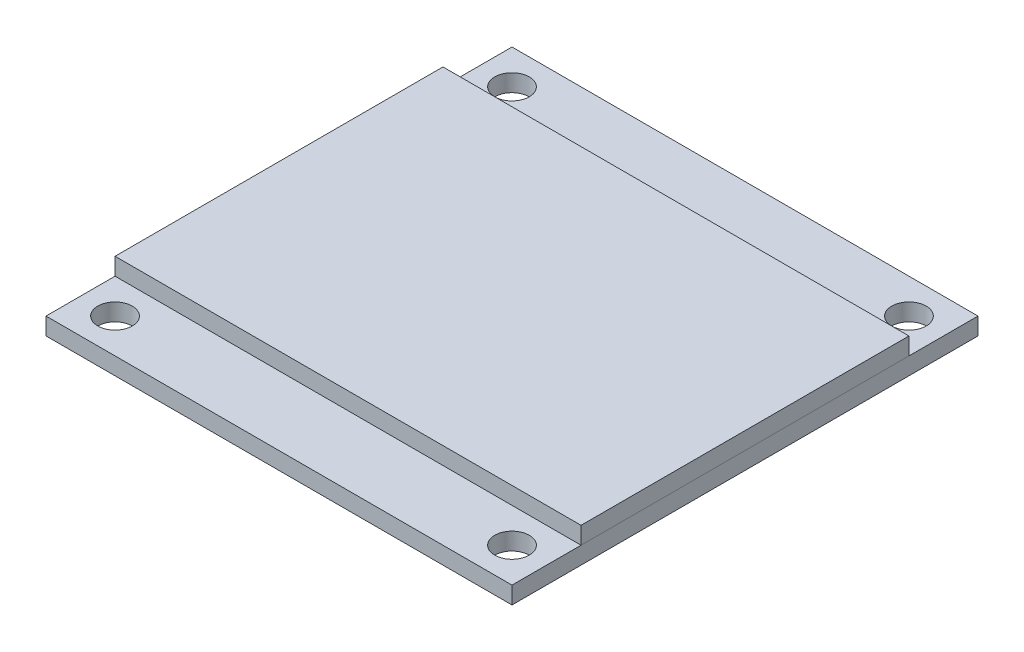
ISO-10303-21;
HEADER;
FILE_DESCRIPTION(('STEP AP214'),'2;1');
FILE_NAME('part.step','',(''),(''),'','','');
FILE_SCHEMA(('AUTOMOTIVE_DESIGN { 1 0 10303 214 1 1 1 1 }'));
ENDSEC;
DATA;
#1=APPLICATION_CONTEXT('core data for automotive mechanical design processes');
#2=APPLICATION_PROTOCOL_DEFINITION('international standard','automotive_design',2000,#1);
#3=PRODUCT_CONTEXT('',#1,'mechanical');
#4=PRODUCT('Part','Part','',(#3));
#5=PRODUCT_RELATED_PRODUCT_CATEGORY('part','',(#4));
#6=PRODUCT_DEFINITION_FORMATION('','',#4);
#7=PRODUCT_DEFINITION_CONTEXT('part definition',#1,'design');
#8=PRODUCT_DEFINITION('design','',#6,#7);
#9=PRODUCT_DEFINITION_SHAPE('','',#8);
#10=(LENGTH_UNIT() NAMED_UNIT(*) SI_UNIT(.MILLI.,.METRE.));
#11=(NAMED_UNIT(*) PLANE_ANGLE_UNIT() SI_UNIT($,.RADIAN.));
#12=(NAMED_UNIT(*) SI_UNIT($,.STERADIAN.) SOLID_ANGLE_UNIT());
#13=UNCERTAINTY_MEASURE_WITH_UNIT(LENGTH_MEASURE(1.E-05),#10,'distance_accuracy_value','');
#14=(GEOMETRIC_REPRESENTATION_CONTEXT(3) GLOBAL_UNCERTAINTY_ASSIGNED_CONTEXT((#13)) GLOBAL_UNIT_ASSIGNED_CONTEXT((#10,
#11,#12)) REPRESENTATION_CONTEXT('',''));
#15=CARTESIAN_POINT('',(0.,0.,0.));
#16=DIRECTION('',(0.,0.,1.));
#17=DIRECTION('',(1.,0.,0.));
#18=AXIS2_PLACEMENT_3D('',#15,#16,#17);
#19=CARTESIAN_POINT('',(13.5,2.,-9.5));
#20=DIRECTION('',(-1.,0.,0.));
#21=DIRECTION('',(0.,0.,1.));
#22=AXIS2_PLACEMENT_3D('',#19,#20,#21);
#23=PLANE('',#22);
#24=DIRECTION('',(0.,0.,-1.));
#25=VECTOR('',#24,1.);
#26=CARTESIAN_POINT('',(13.5,1.,-9.5));
#27=LINE('',#26,#25);
#28=CARTESIAN_POINT('',(13.5,1.,9.5));
#29=VERTEX_POINT('',#28);
#30=CARTESIAN_POINT('',(13.5,1.,-9.5));
#31=VERTEX_POINT('',#30);
#32=EDGE_CURVE('E108',#29,#31,#27,.T.);
#33=ORIENTED_EDGE('',*,*,#32,.T.);
#34=DIRECTION('',(0.,-1.,0.));
#35=VECTOR('',#34,1.);
#36=CARTESIAN_POINT('',(13.5,2.,-9.5));
#37=LINE('',#36,#35);
#38=CARTESIAN_POINT('',(13.5,2.,-9.5));
#39=VERTEX_POINT('',#38);
#40=EDGE_CURVE('E12',#39,#31,#37,.T.);
#41=ORIENTED_EDGE('',*,*,#40,.F.);
#42=DIRECTION('',(0.,0.,-1.));
#43=VECTOR('',#42,1.);
#44=CARTESIAN_POINT('',(13.5,2.,-9.5));
#45=LINE('',#44,#43);
#46=CARTESIAN_POINT('',(13.5,2.,9.5));
#47=VERTEX_POINT('',#46);
#48=EDGE_CURVE('E96',#47,#39,#45,.T.);
#49=ORIENTED_EDGE('',*,*,#48,.F.);
#50=DIRECTION('',(0.,-1.,0.));
#51=VECTOR('',#50,1.);
#52=CARTESIAN_POINT('',(13.5,2.,9.5));
#53=LINE('',#52,#51);
#54=EDGE_CURVE('E104',#47,#29,#53,.T.);
#55=ORIENTED_EDGE('',*,*,#54,.T.);
#56=EDGE_LOOP('',(#33,#41,#49,#55));
#57=FACE_BOUND('',#56,.T.);
#58=ADVANCED_FACE('F45',(#57),#23,.F.);
#59=CARTESIAN_POINT('',(-13.5,2.,-9.5));
#60=DIRECTION('',(0.,0.,1.));
#61=DIRECTION('',(1.,0.,0.));
#62=AXIS2_PLACEMENT_3D('',#59,#60,#61);
#63=PLANE('',#62);
#64=DIRECTION('',(-1.,0.,0.));
#65=VECTOR('',#64,1.);
#66=CARTESIAN_POINT('',(-13.5,1.,-9.5));
#67=LINE('',#66,#65);
#68=CARTESIAN_POINT('',(-13.5,1.,-9.5));
#69=VERTEX_POINT('',#68);
#70=EDGE_CURVE('E100',#31,#69,#67,.T.);
#71=ORIENTED_EDGE('',*,*,#70,.T.);
#72=DIRECTION('',(0.,-1.,0.));
#73=VECTOR('',#72,1.);
#74=CARTESIAN_POINT('',(-13.5,2.,-9.5));
#75=LINE('',#74,#73);
#76=CARTESIAN_POINT('',(-13.5,2.,-9.5));
#77=VERTEX_POINT('',#76);
#78=EDGE_CURVE('E53',#77,#69,#75,.T.);
#79=ORIENTED_EDGE('',*,*,#78,.F.);
#80=DIRECTION('',(-1.,0.,0.));
#81=VECTOR('',#80,1.);
#82=CARTESIAN_POINT('',(-13.5,2.,-9.5));
#83=LINE('',#82,#81);
#84=EDGE_CURVE('E91',#39,#77,#83,.T.);
#85=ORIENTED_EDGE('',*,*,#84,.F.);
#86=ORIENTED_EDGE('',*,*,#40,.T.);
#87=EDGE_LOOP('',(#71,#79,#85,#86));
#88=FACE_BOUND('',#87,.T.);
#89=ADVANCED_FACE('F99',(#88),#63,.F.);
#90=CARTESIAN_POINT('',(-13.5,2.,-9.5));
#91=DIRECTION('',(1.,0.,0.));
#92=DIRECTION('',(0.,0.,-1.));
#93=AXIS2_PLACEMENT_3D('',#90,#91,#92);
#94=PLANE('',#93);
#95=DIRECTION('',(0.,0.,1.));
#96=VECTOR('',#95,1.);
#97=CARTESIAN_POINT('',(-13.5,1.,-9.5));
#98=LINE('',#97,#96);
#99=CARTESIAN_POINT('',(-13.5,1.,9.5));
#100=VERTEX_POINT('',#99);
#101=EDGE_CURVE('E78',#69,#100,#98,.T.);
#102=ORIENTED_EDGE('',*,*,#101,.T.);
#103=DIRECTION('',(0.,-1.,0.));
#104=VECTOR('',#103,1.);
#105=CARTESIAN_POINT('',(-13.5,2.,9.5));
#106=LINE('',#105,#104);
#107=CARTESIAN_POINT('',(-13.5,2.,9.5));
#108=VERTEX_POINT('',#107);
#109=EDGE_CURVE('E101',#108,#100,#106,.T.);
#110=ORIENTED_EDGE('',*,*,#109,.F.);
#111=DIRECTION('',(0.,0.,1.));
#112=VECTOR('',#111,1.);
#113=CARTESIAN_POINT('',(-13.5,2.,-9.5));
#114=LINE('',#113,#112);
#115=EDGE_CURVE('E94',#77,#108,#114,.T.);
#116=ORIENTED_EDGE('',*,*,#115,.F.);
#117=ORIENTED_EDGE('',*,*,#78,.T.);
#118=EDGE_LOOP('',(#102,#110,#116,#117));
#119=FACE_BOUND('',#118,.T.);
#120=ADVANCED_FACE('F102',(#119),#94,.F.);
#121=CARTESIAN_POINT('',(-13.5,2.,9.5));
#122=DIRECTION('',(0.,0.,-1.));
#123=DIRECTION('',(-1.,0.,0.));
#124=AXIS2_PLACEMENT_3D('',#121,#122,#123);
#125=PLANE('',#124);
#126=DIRECTION('',(1.,0.,0.));
#127=VECTOR('',#126,1.);
#128=CARTESIAN_POINT('',(-13.5,1.,9.5));
#129=LINE('',#128,#127);
#130=EDGE_CURVE('E84',#100,#29,#129,.T.);
#131=ORIENTED_EDGE('',*,*,#130,.T.);
#132=ORIENTED_EDGE('',*,*,#54,.F.);
#133=DIRECTION('',(1.,0.,0.));
#134=VECTOR('',#133,1.);
#135=CARTESIAN_POINT('',(-13.5,2.,9.5));
#136=LINE('',#135,#134);
#137=EDGE_CURVE('E61',#108,#47,#136,.T.);
#138=ORIENTED_EDGE('',*,*,#137,.F.);
#139=ORIENTED_EDGE('',*,*,#109,.T.);
#140=EDGE_LOOP('',(#131,#132,#138,#139));
#141=FACE_BOUND('',#140,.T.);
#142=ADVANCED_FACE('F115',(#141),#125,.F.);
#143=CARTESIAN_POINT('',(0.,2.,0.));
#144=DIRECTION('',(0.,1.,0.));
#145=DIRECTION('',(0.,0.,1.));
#146=AXIS2_PLACEMENT_3D('',#143,#144,#145);
#147=PLANE('',#146);
#148=ORIENTED_EDGE('',*,*,#48,.T.);
#149=ORIENTED_EDGE('',*,*,#84,.T.);
#150=ORIENTED_EDGE('',*,*,#115,.T.);
#151=ORIENTED_EDGE('',*,*,#137,.T.);
#152=EDGE_LOOP('',(#148,#149,#150,#151));
#153=FACE_BOUND('',#152,.T.);
#154=ADVANCED_FACE('F92',(#153),#147,.T.);
#155=CARTESIAN_POINT('',(0.,1.,0.));
#156=DIRECTION('',(0.,1.,0.));
#157=DIRECTION('',(0.,0.,1.));
#158=AXIS2_PLACEMENT_3D('',#155,#156,#157);
#159=PLANE('',#158);
#160=ORIENTED_EDGE('',*,*,#32,.F.);
#161=ORIENTED_EDGE('',*,*,#130,.F.);
#162=ORIENTED_EDGE('',*,*,#101,.F.);
#163=ORIENTED_EDGE('',*,*,#70,.F.);
#164=EDGE_LOOP('',(#160,#161,#162,#163));
#165=FACE_BOUND('',#164,.T.);
#166=ADVANCED_FACE('F118',(#165),#159,.F.);
#167=CLOSED_SHELL('',(#58,#89,#120,#142,#154,#166));
#168=MANIFOLD_SOLID_BREP('B2',#167);
#169=CARTESIAN_POINT('',(0.,1.,0.));
#170=DIRECTION('',(0.,1.,0.));
#171=DIRECTION('',(0.,0.,1.));
#172=AXIS2_PLACEMENT_3D('',#169,#170,#171);
#173=PLANE('',#172);
#174=CARTESIAN_POINT('',(11.5,1.,11.5));
#175=DIRECTION('',(0.,1.,0.));
#176=DIRECTION('',(0.,0.,1.));
#177=AXIS2_PLACEMENT_3D('',#174,#175,#176);
#178=CIRCLE('',#177,1.);
#179=CARTESIAN_POINT('',(11.5,1.,12.5));
#180=VERTEX_POINT('',#179);
#181=EDGE_CURVE('E257',#180,#180,#178,.T.);
#182=ORIENTED_EDGE('',*,*,#181,.F.);
#183=EDGE_LOOP('',(#182));
#184=FACE_BOUND('',#183,.T.);
#185=CARTESIAN_POINT('',(-11.5,1.,-11.5));
#186=DIRECTION('',(0.,1.,0.));
#187=DIRECTION('',(0.,0.,1.));
#188=AXIS2_PLACEMENT_3D('',#185,#186,#187);
#189=CIRCLE('',#188,1.);
#190=CARTESIAN_POINT('',(-11.5,1.,-10.5));
#191=VERTEX_POINT('',#190);
#192=EDGE_CURVE('E236',#191,#191,#189,.T.);
#193=ORIENTED_EDGE('',*,*,#192,.F.);
#194=EDGE_LOOP('',(#193));
#195=FACE_BOUND('',#194,.T.);
#196=DIRECTION('',(0.,0.,-1.));
#197=VECTOR('',#196,1.);
#198=CARTESIAN_POINT('',(13.5,1.,-13.5));
#199=LINE('',#198,#197);
#200=CARTESIAN_POINT('',(13.5,1.,13.5));
#201=VERTEX_POINT('',#200);
#202=CARTESIAN_POINT('',(13.5,1.,-13.5));
#203=VERTEX_POINT('',#202);
#204=EDGE_CURVE('E221',#201,#203,#199,.T.);
#205=ORIENTED_EDGE('',*,*,#204,.T.);
#206=DIRECTION('',(-1.,0.,0.));
#207=VECTOR('',#206,1.);
#208=CARTESIAN_POINT('',(-13.5,1.,-13.5));
#209=LINE('',#208,#207);
#210=CARTESIAN_POINT('',(-13.5,1.,-13.5));
#211=VERTEX_POINT('',#210);
#212=EDGE_CURVE('E216',#203,#211,#209,.T.);
#213=ORIENTED_EDGE('',*,*,#212,.T.);
#214=DIRECTION('',(0.,0.,1.));
#215=VECTOR('',#214,1.);
#216=CARTESIAN_POINT('',(-13.5,1.,-13.5));
#217=LINE('',#216,#215);
#218=CARTESIAN_POINT('',(-13.5,1.,13.5));
#219=VERTEX_POINT('',#218);
#220=EDGE_CURVE('E219',#211,#219,#217,.T.);
#221=ORIENTED_EDGE('',*,*,#220,.T.);
#222=DIRECTION('',(1.,0.,0.));
#223=VECTOR('',#222,1.);
#224=CARTESIAN_POINT('',(-13.5,1.,13.5));
#225=LINE('',#224,#223);
#226=EDGE_CURVE('E186',#219,#201,#225,.T.);
#227=ORIENTED_EDGE('',*,*,#226,.T.);
#228=EDGE_LOOP('',(#205,#213,#221,#227));
#229=FACE_BOUND('',#228,.T.);
#230=CARTESIAN_POINT('',(11.5,1.,-11.5));
#231=DIRECTION('',(0.,1.,0.));
#232=DIRECTION('',(0.,0.,1.));
#233=AXIS2_PLACEMENT_3D('',#230,#231,#232);
#234=CIRCLE('',#233,1.);
#235=CARTESIAN_POINT('',(11.5,1.,-10.5));
#236=VERTEX_POINT('',#235);
#237=EDGE_CURVE('E251',#236,#236,#234,.T.);
#238=ORIENTED_EDGE('',*,*,#237,.F.);
#239=EDGE_LOOP('',(#238));
#240=FACE_BOUND('',#239,.T.);
#241=CARTESIAN_POINT('',(-11.5,1.,11.5));
#242=DIRECTION('',(0.,1.,0.));
#243=DIRECTION('',(0.,0.,1.));
#244=AXIS2_PLACEMENT_3D('',#241,#242,#243);
#245=CIRCLE('',#244,0.999999999999999);
#246=CARTESIAN_POINT('',(-11.5,1.,12.5));
#247=VERTEX_POINT('',#246);
#248=EDGE_CURVE('E263',#247,#247,#245,.T.);
#249=ORIENTED_EDGE('',*,*,#248,.F.);
#250=EDGE_LOOP('',(#249));
#251=FACE_BOUND('',#250,.T.);
#252=ADVANCED_FACE('F169',(#184,#195,#229,#240,#251),#173,.T.);
#253=CARTESIAN_POINT('',(0.,0.,0.));
#254=DIRECTION('',(0.,1.,0.));
#255=DIRECTION('',(0.,0.,1.));
#256=AXIS2_PLACEMENT_3D('',#253,#254,#255);
#257=PLANE('',#256);
#258=DIRECTION('',(0.,0.,-1.));
#259=VECTOR('',#258,1.);
#260=CARTESIAN_POINT('',(13.5,0.,-13.5));
#261=LINE('',#260,#259);
#262=CARTESIAN_POINT('',(13.5,0.,13.5));
#263=VERTEX_POINT('',#262);
#264=CARTESIAN_POINT('',(13.5,0.,-13.5));
#265=VERTEX_POINT('',#264);
#266=EDGE_CURVE('E233',#263,#265,#261,.T.);
#267=ORIENTED_EDGE('',*,*,#266,.F.);
#268=DIRECTION('',(1.,0.,0.));
#269=VECTOR('',#268,1.);
#270=CARTESIAN_POINT('',(-13.5,0.,13.5));
#271=LINE('',#270,#269);
#272=CARTESIAN_POINT('',(-13.5,0.,13.5));
#273=VERTEX_POINT('',#272);
#274=EDGE_CURVE('E209',#273,#263,#271,.T.);
#275=ORIENTED_EDGE('',*,*,#274,.F.);
#276=DIRECTION('',(0.,0.,1.));
#277=VECTOR('',#276,1.);
#278=CARTESIAN_POINT('',(-13.5,0.,-13.5));
#279=LINE('',#278,#277);
#280=CARTESIAN_POINT('',(-13.5,0.,-13.5));
#281=VERTEX_POINT('',#280);
#282=EDGE_CURVE('E203',#281,#273,#279,.T.);
#283=ORIENTED_EDGE('',*,*,#282,.F.);
#284=DIRECTION('',(-1.,0.,0.));
#285=VECTOR('',#284,1.);
#286=CARTESIAN_POINT('',(-13.5,0.,-13.5));
#287=LINE('',#286,#285);
#288=EDGE_CURVE('E225',#265,#281,#287,.T.);
#289=ORIENTED_EDGE('',*,*,#288,.F.);
#290=EDGE_LOOP('',(#267,#275,#283,#289));
#291=FACE_BOUND('',#290,.T.);
#292=CARTESIAN_POINT('',(-11.5,0.,-11.5));
#293=DIRECTION('',(0.,1.,0.));
#294=DIRECTION('',(0.,0.,1.));
#295=AXIS2_PLACEMENT_3D('',#292,#293,#294);
#296=CIRCLE('',#295,1.);
#297=CARTESIAN_POINT('',(-11.5,0.,-10.5));
#298=VERTEX_POINT('',#297);
#299=EDGE_CURVE('E248',#298,#298,#296,.T.);
#300=ORIENTED_EDGE('',*,*,#299,.T.);
#301=EDGE_LOOP('',(#300));
#302=FACE_BOUND('',#301,.T.);
#303=CARTESIAN_POINT('',(11.5,0.,-11.5));
#304=DIRECTION('',(0.,1.,0.));
#305=DIRECTION('',(0.,0.,1.));
#306=AXIS2_PLACEMENT_3D('',#303,#304,#305);
#307=CIRCLE('',#306,1.);
#308=CARTESIAN_POINT('',(11.5,0.,-10.5));
#309=VERTEX_POINT('',#308);
#310=EDGE_CURVE('E254',#309,#309,#307,.T.);
#311=ORIENTED_EDGE('',*,*,#310,.T.);
#312=EDGE_LOOP('',(#311));
#313=FACE_BOUND('',#312,.T.);
#314=CARTESIAN_POINT('',(11.5,0.,11.5));
#315=DIRECTION('',(0.,1.,0.));
#316=DIRECTION('',(0.,0.,1.));
#317=AXIS2_PLACEMENT_3D('',#314,#315,#316);
#318=CIRCLE('',#317,1.);
#319=CARTESIAN_POINT('',(11.5,0.,12.5));
#320=VERTEX_POINT('',#319);
#321=EDGE_CURVE('E260',#320,#320,#318,.T.);
#322=ORIENTED_EDGE('',*,*,#321,.T.);
#323=EDGE_LOOP('',(#322));
#324=FACE_BOUND('',#323,.T.);
#325=CARTESIAN_POINT('',(-11.5,0.,11.5));
#326=DIRECTION('',(0.,1.,0.));
#327=DIRECTION('',(0.,0.,1.));
#328=AXIS2_PLACEMENT_3D('',#325,#326,#327);
#329=CIRCLE('',#328,0.999999999999999);
#330=CARTESIAN_POINT('',(-11.5,0.,12.5));
#331=VERTEX_POINT('',#330);
#332=EDGE_CURVE('E266',#331,#331,#329,.T.);
#333=ORIENTED_EDGE('',*,*,#332,.T.);
#334=EDGE_LOOP('',(#333));
#335=FACE_BOUND('',#334,.T.);
#336=ADVANCED_FACE('F244',(#291,#302,#313,#324,#335),#257,.F.);
#337=CARTESIAN_POINT('',(13.5,1.,-13.5));
#338=DIRECTION('',(-1.,0.,0.));
#339=DIRECTION('',(0.,0.,1.));
#340=AXIS2_PLACEMENT_3D('',#337,#338,#339);
#341=PLANE('',#340);
#342=ORIENTED_EDGE('',*,*,#266,.T.);
#343=DIRECTION('',(0.,-1.,0.));
#344=VECTOR('',#343,1.);
#345=CARTESIAN_POINT('',(13.5,1.,-13.5));
#346=LINE('',#345,#344);
#347=EDGE_CURVE('E43',#203,#265,#346,.T.);
#348=ORIENTED_EDGE('',*,*,#347,.F.);
#349=ORIENTED_EDGE('',*,*,#204,.F.);
#350=DIRECTION('',(0.,-1.,0.));
#351=VECTOR('',#350,1.);
#352=CARTESIAN_POINT('',(13.5,1.,13.5));
#353=LINE('',#352,#351);
#354=EDGE_CURVE('E229',#201,#263,#353,.T.);
#355=ORIENTED_EDGE('',*,*,#354,.T.);
#356=EDGE_LOOP('',(#342,#348,#349,#355));
#357=FACE_BOUND('',#356,.T.);
#358=ADVANCED_FACE('F171',(#357),#341,.F.);
#359=CARTESIAN_POINT('',(-13.5,1.,-13.5));
#360=DIRECTION('',(0.,0.,1.));
#361=DIRECTION('',(1.,0.,0.));
#362=AXIS2_PLACEMENT_3D('',#359,#360,#361);
#363=PLANE('',#362);
#364=ORIENTED_EDGE('',*,*,#288,.T.);
#365=DIRECTION('',(0.,-1.,0.));
#366=VECTOR('',#365,1.);
#367=CARTESIAN_POINT('',(-13.5,1.,-13.5));
#368=LINE('',#367,#366);
#369=EDGE_CURVE('E178',#211,#281,#368,.T.);
#370=ORIENTED_EDGE('',*,*,#369,.F.);
#371=ORIENTED_EDGE('',*,*,#212,.F.);
#372=ORIENTED_EDGE('',*,*,#347,.T.);
#373=EDGE_LOOP('',(#364,#370,#371,#372));
#374=FACE_BOUND('',#373,.T.);
#375=ADVANCED_FACE('F224',(#374),#363,.F.);
#376=CARTESIAN_POINT('',(-13.5,1.,-13.5));
#377=DIRECTION('',(1.,0.,0.));
#378=DIRECTION('',(0.,0.,-1.));
#379=AXIS2_PLACEMENT_3D('',#376,#377,#378);
#380=PLANE('',#379);
#381=ORIENTED_EDGE('',*,*,#282,.T.);
#382=DIRECTION('',(0.,-1.,0.));
#383=VECTOR('',#382,1.);
#384=CARTESIAN_POINT('',(-13.5,1.,13.5));
#385=LINE('',#384,#383);
#386=EDGE_CURVE('E226',#219,#273,#385,.T.);
#387=ORIENTED_EDGE('',*,*,#386,.F.);
#388=ORIENTED_EDGE('',*,*,#220,.F.);
#389=ORIENTED_EDGE('',*,*,#369,.T.);
#390=EDGE_LOOP('',(#381,#387,#388,#389));
#391=FACE_BOUND('',#390,.T.);
#392=ADVANCED_FACE('F227',(#391),#380,.F.);
#393=CARTESIAN_POINT('',(-13.5,1.,13.5));
#394=DIRECTION('',(0.,0.,-1.));
#395=DIRECTION('',(-1.,0.,0.));
#396=AXIS2_PLACEMENT_3D('',#393,#394,#395);
#397=PLANE('',#396);
#398=ORIENTED_EDGE('',*,*,#274,.T.);
#399=ORIENTED_EDGE('',*,*,#354,.F.);
#400=ORIENTED_EDGE('',*,*,#226,.F.);
#401=ORIENTED_EDGE('',*,*,#386,.T.);
#402=EDGE_LOOP('',(#398,#399,#400,#401));
#403=FACE_BOUND('',#402,.T.);
#404=ADVANCED_FACE('F241',(#403),#397,.F.);
#405=CARTESIAN_POINT('',(-11.5,1.,-11.5));
#406=DIRECTION('',(0.,-1.,0.));
#407=DIRECTION('',(0.,0.,-1.));
#408=AXIS2_PLACEMENT_3D('',#405,#406,#407);
#409=CYLINDRICAL_SURFACE('',#408,1.);
#410=ORIENTED_EDGE('',*,*,#192,.T.);
#411=EDGE_LOOP('',(#410));
#412=FACE_BOUND('',#411,.T.);
#413=ORIENTED_EDGE('',*,*,#299,.F.);
#414=EDGE_LOOP('',(#413));
#415=FACE_BOUND('',#414,.T.);
#416=ADVANCED_FACE('F285',(#412,#415),#409,.F.);
#417=CARTESIAN_POINT('',(11.5,1.,-11.5));
#418=DIRECTION('',(0.,-1.,0.));
#419=DIRECTION('',(0.,0.,-1.));
#420=AXIS2_PLACEMENT_3D('',#417,#418,#419);
#421=CYLINDRICAL_SURFACE('',#420,1.);
#422=ORIENTED_EDGE('',*,*,#237,.T.);
#423=EDGE_LOOP('',(#422));
#424=FACE_BOUND('',#423,.T.);
#425=ORIENTED_EDGE('',*,*,#310,.F.);
#426=EDGE_LOOP('',(#425));
#427=FACE_BOUND('',#426,.T.);
#428=ADVANCED_FACE('F336',(#424,#427),#421,.F.);
#429=CARTESIAN_POINT('',(11.5,1.,11.5));
#430=DIRECTION('',(0.,-1.,0.));
#431=DIRECTION('',(0.,0.,-1.));
#432=AXIS2_PLACEMENT_3D('',#429,#430,#431);
#433=CYLINDRICAL_SURFACE('',#432,1.);
#434=ORIENTED_EDGE('',*,*,#181,.T.);
#435=EDGE_LOOP('',(#434));
#436=FACE_BOUND('',#435,.T.);
#437=ORIENTED_EDGE('',*,*,#321,.F.);
#438=EDGE_LOOP('',(#437));
#439=FACE_BOUND('',#438,.T.);
#440=ADVANCED_FACE('F345',(#436,#439),#433,.F.);
#441=CARTESIAN_POINT('',(-11.5,1.,11.5));
#442=DIRECTION('',(0.,-1.,0.));
#443=DIRECTION('',(0.,0.,-1.));
#444=AXIS2_PLACEMENT_3D('',#441,#442,#443);
#445=CYLINDRICAL_SURFACE('',#444,0.999999999999999);
#446=ORIENTED_EDGE('',*,*,#248,.T.);
#447=EDGE_LOOP('',(#446));
#448=FACE_BOUND('',#447,.T.);
#449=ORIENTED_EDGE('',*,*,#332,.F.);
#450=EDGE_LOOP('',(#449));
#451=FACE_BOUND('',#450,.T.);
#452=ADVANCED_FACE('F272',(#448,#451),#445,.F.);
#453=CLOSED_SHELL('',(#252,#336,#358,#375,#392,#404,#416,#428,#440,#452));
#454=MANIFOLD_SOLID_BREP('B6',#453);
#455=ADVANCED_BREP_SHAPE_REPRESENTATION('',(#18,#168,#454),#14);
#456=SHAPE_DEFINITION_REPRESENTATION(#9,#455);
ENDSEC;
END-ISO-10303-21;
